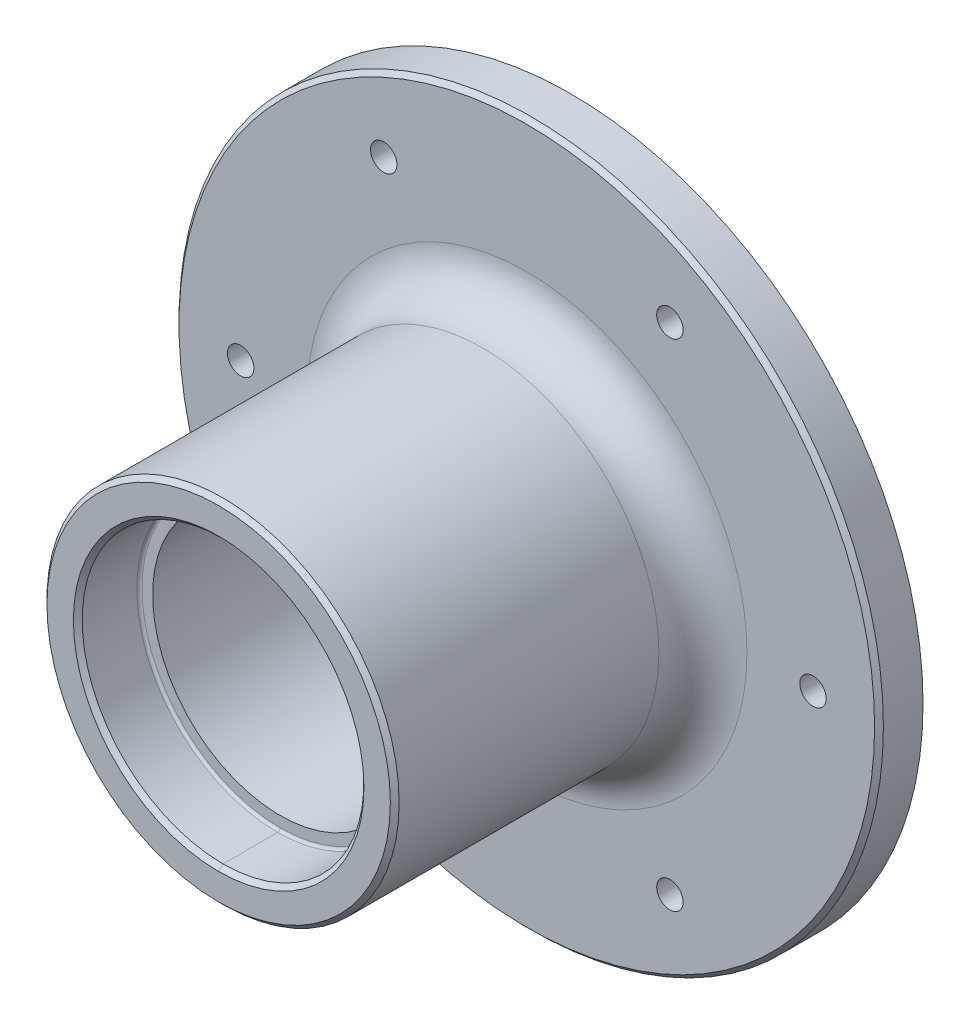
ISO-10303-21;
HEADER;
FILE_DESCRIPTION(('STEP AP214'),'2;1');
FILE_NAME('part.step','',(''),(''),'','','');
FILE_SCHEMA(('AUTOMOTIVE_DESIGN { 1 0 10303 214 1 1 1 1 }'));
ENDSEC;
DATA;
#1=APPLICATION_CONTEXT('core data for automotive mechanical design processes');
#2=APPLICATION_PROTOCOL_DEFINITION('international standard','automotive_design',2000,#1);
#3=PRODUCT_CONTEXT('',#1,'mechanical');
#4=PRODUCT('Part','Part','',(#3));
#5=PRODUCT_RELATED_PRODUCT_CATEGORY('part','',(#4));
#6=PRODUCT_DEFINITION_FORMATION('','',#4);
#7=PRODUCT_DEFINITION_CONTEXT('part definition',#1,'design');
#8=PRODUCT_DEFINITION('design','',#6,#7);
#9=PRODUCT_DEFINITION_SHAPE('','',#8);
#10=(LENGTH_UNIT() NAMED_UNIT(*) SI_UNIT(.MILLI.,.METRE.));
#11=(NAMED_UNIT(*) PLANE_ANGLE_UNIT() SI_UNIT($,.RADIAN.));
#12=(NAMED_UNIT(*) SI_UNIT($,.STERADIAN.) SOLID_ANGLE_UNIT());
#13=UNCERTAINTY_MEASURE_WITH_UNIT(LENGTH_MEASURE(1.E-05),#10,'distance_accuracy_value','');
#14=(GEOMETRIC_REPRESENTATION_CONTEXT(3) GLOBAL_UNCERTAINTY_ASSIGNED_CONTEXT((#13)) GLOBAL_UNIT_ASSIGNED_CONTEXT((#10,
#11,#12)) REPRESENTATION_CONTEXT('',''));
#15=CARTESIAN_POINT('',(0.,0.,0.));
#16=DIRECTION('',(0.,0.,1.));
#17=DIRECTION('',(1.,0.,0.));
#18=AXIS2_PLACEMENT_3D('',#15,#16,#17);
#19=CARTESIAN_POINT('',(0.,0.,56.3012313454445));
#20=DIRECTION('',(0.,0.,1.));
#21=DIRECTION('',(1.,0.,0.));
#22=AXIS2_PLACEMENT_3D('',#19,#20,#21);
#23=CYLINDRICAL_SURFACE('',#22,16.);
#24=DIRECTION('',(0.,0.,1.));
#25=VECTOR('',#24,1.);
#26=CARTESIAN_POINT('',(2.6562498279557E-13,16.,56.3012313454445));
#27=LINE('',#26,#25);
#28=CARTESIAN_POINT('',(2.6562498279557E-13,16.,39.5));
#29=VERTEX_POINT('',#28);
#30=CARTESIAN_POINT('',(2.6562498279557E-13,16.,33.3));
#31=VERTEX_POINT('',#30);
#32=EDGE_CURVE('E197',#29,#31,#27,.F.);
#33=ORIENTED_EDGE('',*,*,#32,.T.);
#34=CARTESIAN_POINT('',(0.,0.,33.3));
#35=DIRECTION('',(0.,0.,1.));
#36=DIRECTION('',(1.,0.,0.));
#37=AXIS2_PLACEMENT_3D('',#34,#35,#36);
#38=CIRCLE('',#37,16.);
#39=CARTESIAN_POINT('',(2.6562498279557E-13,-16.,33.3));
#40=VERTEX_POINT('',#39);
#41=EDGE_CURVE('E45',#31,#40,#38,.F.);
#42=ORIENTED_EDGE('',*,*,#41,.T.);
#43=DIRECTION('',(0.,0.,1.));
#44=VECTOR('',#43,1.);
#45=CARTESIAN_POINT('',(2.6562498279557E-13,-16.,56.3012313454445));
#46=LINE('',#45,#44);
#47=CARTESIAN_POINT('',(2.6562498279557E-13,-16.,39.5));
#48=VERTEX_POINT('',#47);
#49=EDGE_CURVE('E120',#40,#48,#46,.T.);
#50=ORIENTED_EDGE('',*,*,#49,.T.);
#51=CARTESIAN_POINT('',(0.,0.,39.5));
#52=DIRECTION('',(0.,0.,1.));
#53=DIRECTION('',(1.,0.,0.));
#54=AXIS2_PLACEMENT_3D('',#51,#52,#53);
#55=CIRCLE('',#54,16.);
#56=EDGE_CURVE('E141',#48,#29,#55,.T.);
#57=ORIENTED_EDGE('',*,*,#56,.T.);
#58=EDGE_LOOP('',(#33,#42,#50,#57));
#59=FACE_BOUND('',#58,.T.);
#60=ADVANCED_FACE('F36',(#59),#23,.F.);
#61=CARTESIAN_POINT('',(0.,0.,56.3012313454445));
#62=DIRECTION('',(0.,0.,1.));
#63=DIRECTION('',(1.,0.,0.));
#64=AXIS2_PLACEMENT_3D('',#61,#62,#63);
#65=CYLINDRICAL_SURFACE('',#64,16.);
#66=DIRECTION('',(0.,0.,1.));
#67=VECTOR('',#66,1.);
#68=CARTESIAN_POINT('',(0.,-16.,56.3012313454445));
#69=LINE('',#68,#67);
#70=CARTESIAN_POINT('',(0.,-16.,0.500000000000007));
#71=VERTEX_POINT('',#70);
#72=CARTESIAN_POINT('',(0.,-16.,6.7));
#73=VERTEX_POINT('',#72);
#74=EDGE_CURVE('E193',#71,#73,#69,.T.);
#75=ORIENTED_EDGE('',*,*,#74,.T.);
#76=CARTESIAN_POINT('',(0.,0.,6.7));
#77=DIRECTION('',(0.,0.,-1.));
#78=DIRECTION('',(-1.,0.,0.));
#79=AXIS2_PLACEMENT_3D('',#76,#77,#78);
#80=CIRCLE('',#79,16.);
#81=CARTESIAN_POINT('',(0.,16.,6.7));
#82=VERTEX_POINT('',#81);
#83=EDGE_CURVE('E11',#73,#82,#80,.F.);
#84=ORIENTED_EDGE('',*,*,#83,.T.);
#85=DIRECTION('',(0.,0.,1.));
#86=VECTOR('',#85,1.);
#87=CARTESIAN_POINT('',(0.,16.,56.3012313454445));
#88=LINE('',#87,#86);
#89=CARTESIAN_POINT('',(0.,16.,0.500000000000007));
#90=VERTEX_POINT('',#89);
#91=EDGE_CURVE('E194',#82,#90,#88,.F.);
#92=ORIENTED_EDGE('',*,*,#91,.T.);
#93=CARTESIAN_POINT('',(0.,0.,0.500000000000007));
#94=DIRECTION('',(0.,0.,1.));
#95=DIRECTION('',(1.,0.,0.));
#96=AXIS2_PLACEMENT_3D('',#93,#94,#95);
#97=CIRCLE('',#96,16.);
#98=EDGE_CURVE('E125',#90,#71,#97,.F.);
#99=ORIENTED_EDGE('',*,*,#98,.T.);
#100=EDGE_LOOP('',(#75,#84,#92,#99));
#101=FACE_BOUND('',#100,.T.);
#102=ADVANCED_FACE('F195',(#101),#65,.F.);
#103=CARTESIAN_POINT('',(0.,0.,0.));
#104=DIRECTION('',(0.,0.,1.));
#105=DIRECTION('',(1.,0.,0.));
#106=AXIS2_PLACEMENT_3D('',#103,#104,#105);
#107=PLANE('',#106);
#108=CARTESIAN_POINT('',(0.,0.,0.));
#109=DIRECTION('',(0.,0.,1.));
#110=DIRECTION('',(1.,0.,0.));
#111=AXIS2_PLACEMENT_3D('',#108,#109,#110);
#112=CIRCLE('',#111,16.5);
#113=CARTESIAN_POINT('',(0.,-16.5,0.));
#114=VERTEX_POINT('',#113);
#115=CARTESIAN_POINT('',(0.,16.5,0.));
#116=VERTEX_POINT('',#115);
#117=EDGE_CURVE('E117',#114,#116,#112,.T.);
#118=ORIENTED_EDGE('',*,*,#117,.T.);
#119=CARTESIAN_POINT('',(0.,0.,0.));
#120=DIRECTION('',(0.,0.,1.));
#121=DIRECTION('',(1.,0.,0.));
#122=AXIS2_PLACEMENT_3D('',#119,#120,#121);
#123=CIRCLE('',#122,16.5);
#124=EDGE_CURVE('E108',#116,#114,#123,.T.);
#125=ORIENTED_EDGE('',*,*,#124,.T.);
#126=EDGE_LOOP('',(#118,#125));
#127=FACE_BOUND('',#126,.T.);
#128=CARTESIAN_POINT('',(16.2500000000003,28.1458256229941,0.));
#129=DIRECTION('',(0.,0.,-1.));
#130=DIRECTION('',(-1.,0.,0.));
#131=AXIS2_PLACEMENT_3D('',#128,#129,#130);
#132=CIRCLE('',#131,1.49999999999999);
#133=CARTESIAN_POINT('',(14.7500000000003,28.1458256229941,0.));
#134=VERTEX_POINT('',#133);
#135=EDGE_CURVE('E154',#134,#134,#132,.T.);
#136=ORIENTED_EDGE('',*,*,#135,.F.);
#137=EDGE_LOOP('',(#136));
#138=FACE_BOUND('',#137,.T.);
#139=CARTESIAN_POINT('',(-16.2499999999997,28.1458256229944,0.));
#140=DIRECTION('',(0.,0.,-1.));
#141=DIRECTION('',(-1.,0.,0.));
#142=AXIS2_PLACEMENT_3D('',#139,#140,#141);
#143=CIRCLE('',#142,1.49999999999999);
#144=CARTESIAN_POINT('',(-17.7499999999997,28.1458256229944,0.));
#145=VERTEX_POINT('',#144);
#146=EDGE_CURVE('E278',#145,#145,#143,.T.);
#147=ORIENTED_EDGE('',*,*,#146,.F.);
#148=EDGE_LOOP('',(#147));
#149=FACE_BOUND('',#148,.T.);
#150=CARTESIAN_POINT('',(-32.5,0.,0.));
#151=DIRECTION('',(0.,0.,-1.));
#152=DIRECTION('',(-1.,0.,0.));
#153=AXIS2_PLACEMENT_3D('',#150,#151,#152);
#154=CIRCLE('',#153,1.49999999999999);
#155=CARTESIAN_POINT('',(-34.,0.,0.));
#156=VERTEX_POINT('',#155);
#157=EDGE_CURVE('E272',#156,#156,#154,.T.);
#158=ORIENTED_EDGE('',*,*,#157,.F.);
#159=EDGE_LOOP('',(#158));
#160=FACE_BOUND('',#159,.T.);
#161=CARTESIAN_POINT('',(-16.2500000000001,-28.1458256229942,0.));
#162=DIRECTION('',(0.,0.,-1.));
#163=DIRECTION('',(-1.,0.,0.));
#164=AXIS2_PLACEMENT_3D('',#161,#162,#163);
#165=CIRCLE('',#164,1.49999999999999);
#166=CARTESIAN_POINT('',(-17.7500000000001,-28.1458256229942,0.));
#167=VERTEX_POINT('',#166);
#168=EDGE_CURVE('E266',#167,#167,#165,.T.);
#169=ORIENTED_EDGE('',*,*,#168,.F.);
#170=EDGE_LOOP('',(#169));
#171=FACE_BOUND('',#170,.T.);
#172=CARTESIAN_POINT('',(32.5,0.,0.));
#173=DIRECTION('',(0.,0.,-1.));
#174=DIRECTION('',(-1.,0.,0.));
#175=AXIS2_PLACEMENT_3D('',#172,#173,#174);
#176=CIRCLE('',#175,1.49999999999999);
#177=CARTESIAN_POINT('',(31.,0.,0.));
#178=VERTEX_POINT('',#177);
#179=EDGE_CURVE('E254',#178,#178,#176,.T.);
#180=ORIENTED_EDGE('',*,*,#179,.F.);
#181=EDGE_LOOP('',(#180));
#182=FACE_BOUND('',#181,.T.);
#183=CARTESIAN_POINT('',(0.,0.,0.));
#184=DIRECTION('',(0.,0.,1.));
#185=DIRECTION('',(1.,0.,0.));
#186=AXIS2_PLACEMENT_3D('',#183,#184,#185);
#187=CIRCLE('',#186,40.);
#188=CARTESIAN_POINT('',(40.,0.,0.));
#189=VERTEX_POINT('',#188);
#190=EDGE_CURVE('E204',#189,#189,#187,.T.);
#191=ORIENTED_EDGE('',*,*,#190,.F.);
#192=EDGE_LOOP('',(#191));
#193=FACE_BOUND('',#192,.T.);
#194=CARTESIAN_POINT('',(16.2499999999999,-28.1458256229943,0.));
#195=DIRECTION('',(0.,0.,-1.));
#196=DIRECTION('',(-1.,0.,0.));
#197=AXIS2_PLACEMENT_3D('',#194,#195,#196);
#198=CIRCLE('',#197,1.49999999999999);
#199=CARTESIAN_POINT('',(14.7499999999999,-28.1458256229943,0.));
#200=VERTEX_POINT('',#199);
#201=EDGE_CURVE('E260',#200,#200,#198,.T.);
#202=ORIENTED_EDGE('',*,*,#201,.F.);
#203=EDGE_LOOP('',(#202));
#204=FACE_BOUND('',#203,.T.);
#205=ADVANCED_FACE('F122',(#127,#138,#149,#160,#171,#182,#193,#204),#107,.F.);
#206=CARTESIAN_POINT('',(0.,0.,5.));
#207=DIRECTION('',(0.,0.,-1.));
#208=DIRECTION('',(-1.,0.,0.));
#209=AXIS2_PLACEMENT_3D('',#206,#207,#208);
#210=CYLINDRICAL_SURFACE('',#209,40.);
#211=CARTESIAN_POINT('',(0.,0.,4.49999999999999));
#212=DIRECTION('',(0.,0.,1.));
#213=DIRECTION('',(1.,0.,0.));
#214=AXIS2_PLACEMENT_3D('',#211,#212,#213);
#215=CIRCLE('',#214,40.);
#216=CARTESIAN_POINT('',(40.,0.,4.49999999999999));
#217=VERTEX_POINT('',#216);
#218=EDGE_CURVE('E149',#217,#217,#215,.F.);
#219=ORIENTED_EDGE('',*,*,#218,.T.);
#220=EDGE_LOOP('',(#219));
#221=FACE_BOUND('',#220,.T.);
#222=ORIENTED_EDGE('',*,*,#190,.T.);
#223=EDGE_LOOP('',(#222));
#224=FACE_BOUND('',#223,.T.);
#225=ADVANCED_FACE('F290',(#221,#224),#210,.T.);
#226=CARTESIAN_POINT('',(0.,0.,5.));
#227=DIRECTION('',(0.,0.,1.));
#228=DIRECTION('',(1.,0.,0.));
#229=AXIS2_PLACEMENT_3D('',#226,#227,#228);
#230=PLANE('',#229);
#231=CARTESIAN_POINT('',(0.,0.,5.));
#232=DIRECTION('',(0.,0.,1.));
#233=DIRECTION('',(1.,0.,0.));
#234=AXIS2_PLACEMENT_3D('',#231,#232,#233);
#235=CIRCLE('',#234,25.);
#236=CARTESIAN_POINT('',(25.,0.,5.));
#237=VERTEX_POINT('',#236);
#238=EDGE_CURVE('E162',#237,#237,#235,.F.);
#239=ORIENTED_EDGE('',*,*,#238,.T.);
#240=EDGE_LOOP('',(#239));
#241=FACE_BOUND('',#240,.T.);
#242=CARTESIAN_POINT('',(0.,0.,5.));
#243=DIRECTION('',(0.,0.,1.));
#244=DIRECTION('',(1.,0.,0.));
#245=AXIS2_PLACEMENT_3D('',#242,#243,#244);
#246=CIRCLE('',#245,39.5);
#247=CARTESIAN_POINT('',(39.5,0.,5.));
#248=VERTEX_POINT('',#247);
#249=EDGE_CURVE('E146',#248,#248,#246,.T.);
#250=ORIENTED_EDGE('',*,*,#249,.T.);
#251=EDGE_LOOP('',(#250));
#252=FACE_BOUND('',#251,.T.);
#253=CARTESIAN_POINT('',(16.2500000000003,28.1458256229941,5.));
#254=DIRECTION('',(0.,0.,1.));
#255=DIRECTION('',(1.,0.,0.));
#256=AXIS2_PLACEMENT_3D('',#253,#254,#255);
#257=CIRCLE('',#256,1.49999999999999);
#258=CARTESIAN_POINT('',(17.7500000000003,28.1458256229941,5.));
#259=VERTEX_POINT('',#258);
#260=EDGE_CURVE('E281',#259,#259,#257,.T.);
#261=ORIENTED_EDGE('',*,*,#260,.F.);
#262=EDGE_LOOP('',(#261));
#263=FACE_BOUND('',#262,.T.);
#264=CARTESIAN_POINT('',(-16.2499999999997,28.1458256229944,5.));
#265=DIRECTION('',(0.,0.,1.));
#266=DIRECTION('',(1.,0.,0.));
#267=AXIS2_PLACEMENT_3D('',#264,#265,#266);
#268=CIRCLE('',#267,1.49999999999999);
#269=CARTESIAN_POINT('',(-14.7499999999997,28.1458256229944,5.));
#270=VERTEX_POINT('',#269);
#271=EDGE_CURVE('E275',#270,#270,#268,.T.);
#272=ORIENTED_EDGE('',*,*,#271,.F.);
#273=EDGE_LOOP('',(#272));
#274=FACE_BOUND('',#273,.T.);
#275=CARTESIAN_POINT('',(-32.5,0.,5.));
#276=DIRECTION('',(0.,0.,1.));
#277=DIRECTION('',(1.,0.,0.));
#278=AXIS2_PLACEMENT_3D('',#275,#276,#277);
#279=CIRCLE('',#278,1.49999999999999);
#280=CARTESIAN_POINT('',(-31.,0.,5.));
#281=VERTEX_POINT('',#280);
#282=EDGE_CURVE('E269',#281,#281,#279,.T.);
#283=ORIENTED_EDGE('',*,*,#282,.F.);
#284=EDGE_LOOP('',(#283));
#285=FACE_BOUND('',#284,.T.);
#286=CARTESIAN_POINT('',(-16.2500000000001,-28.1458256229942,5.));
#287=DIRECTION('',(0.,0.,1.));
#288=DIRECTION('',(1.,0.,0.));
#289=AXIS2_PLACEMENT_3D('',#286,#287,#288);
#290=CIRCLE('',#289,1.49999999999999);
#291=CARTESIAN_POINT('',(-14.7500000000001,-28.1458256229942,5.));
#292=VERTEX_POINT('',#291);
#293=EDGE_CURVE('E263',#292,#292,#290,.T.);
#294=ORIENTED_EDGE('',*,*,#293,.F.);
#295=EDGE_LOOP('',(#294));
#296=FACE_BOUND('',#295,.T.);
#297=CARTESIAN_POINT('',(16.2499999999999,-28.1458256229943,5.));
#298=DIRECTION('',(0.,0.,1.));
#299=DIRECTION('',(1.,0.,0.));
#300=AXIS2_PLACEMENT_3D('',#297,#298,#299);
#301=CIRCLE('',#300,1.49999999999999);
#302=CARTESIAN_POINT('',(17.7499999999999,-28.1458256229943,5.));
#303=VERTEX_POINT('',#302);
#304=EDGE_CURVE('E257',#303,#303,#301,.T.);
#305=ORIENTED_EDGE('',*,*,#304,.F.);
#306=EDGE_LOOP('',(#305));
#307=FACE_BOUND('',#306,.T.);
#308=CARTESIAN_POINT('',(32.5,0.,5.));
#309=DIRECTION('',(0.,0.,1.));
#310=DIRECTION('',(1.,0.,0.));
#311=AXIS2_PLACEMENT_3D('',#308,#309,#310);
#312=CIRCLE('',#311,1.49999999999999);
#313=CARTESIAN_POINT('',(34.,0.,5.));
#314=VERTEX_POINT('',#313);
#315=EDGE_CURVE('E207',#314,#314,#312,.T.);
#316=ORIENTED_EDGE('',*,*,#315,.F.);
#317=EDGE_LOOP('',(#316));
#318=FACE_BOUND('',#317,.T.);
#319=ADVANCED_FACE('F336',(#241,#252,#263,#274,#285,#296,#307,#318),#230,.T.);
#320=CARTESIAN_POINT('',(0.,0.,40.));
#321=DIRECTION('',(0.,0.,-1.));
#322=DIRECTION('',(-1.,0.,0.));
#323=AXIS2_PLACEMENT_3D('',#320,#321,#322);
#324=CYLINDRICAL_SURFACE('',#323,20.);
#325=CARTESIAN_POINT('',(0.,0.,10.));
#326=DIRECTION('',(0.,0.,1.));
#327=DIRECTION('',(1.,0.,0.));
#328=AXIS2_PLACEMENT_3D('',#325,#326,#327);
#329=CIRCLE('',#328,20.);
#330=CARTESIAN_POINT('',(20.,0.,10.));
#331=VERTEX_POINT('',#330);
#332=EDGE_CURVE('E151',#331,#331,#329,.T.);
#333=ORIENTED_EDGE('',*,*,#332,.T.);
#334=EDGE_LOOP('',(#333));
#335=FACE_BOUND('',#334,.T.);
#336=CARTESIAN_POINT('',(0.,0.,39.5));
#337=DIRECTION('',(0.,0.,1.));
#338=DIRECTION('',(1.,0.,0.));
#339=AXIS2_PLACEMENT_3D('',#336,#337,#338);
#340=CIRCLE('',#339,20.);
#341=CARTESIAN_POINT('',(20.,0.,39.5));
#342=VERTEX_POINT('',#341);
#343=EDGE_CURVE('E143',#342,#342,#340,.F.);
#344=ORIENTED_EDGE('',*,*,#343,.T.);
#345=EDGE_LOOP('',(#344));
#346=FACE_BOUND('',#345,.T.);
#347=ADVANCED_FACE('F331',(#335,#346),#324,.T.);
#348=CARTESIAN_POINT('',(0.,0.,40.));
#349=DIRECTION('',(0.,0.,1.));
#350=DIRECTION('',(1.,0.,0.));
#351=AXIS2_PLACEMENT_3D('',#348,#349,#350);
#352=PLANE('',#351);
#353=CARTESIAN_POINT('',(0.,0.,40.));
#354=DIRECTION('',(0.,0.,1.));
#355=DIRECTION('',(1.,0.,0.));
#356=AXIS2_PLACEMENT_3D('',#353,#354,#355);
#357=CIRCLE('',#356,16.5);
#358=CARTESIAN_POINT('',(2.73925763507931E-13,16.5,40.));
#359=VERTEX_POINT('',#358);
#360=CARTESIAN_POINT('',(2.73925763507931E-13,-16.5,40.));
#361=VERTEX_POINT('',#360);
#362=EDGE_CURVE('E136',#359,#361,#357,.F.);
#363=ORIENTED_EDGE('',*,*,#362,.T.);
#364=CARTESIAN_POINT('',(0.,0.,40.));
#365=DIRECTION('',(0.,0.,1.));
#366=DIRECTION('',(1.,0.,0.));
#367=AXIS2_PLACEMENT_3D('',#364,#365,#366);
#368=CIRCLE('',#367,16.5);
#369=EDGE_CURVE('E138',#361,#359,#368,.F.);
#370=ORIENTED_EDGE('',*,*,#369,.T.);
#371=EDGE_LOOP('',(#363,#370));
#372=FACE_BOUND('',#371,.T.);
#373=CARTESIAN_POINT('',(0.,0.,40.));
#374=DIRECTION('',(0.,0.,1.));
#375=DIRECTION('',(1.,0.,0.));
#376=AXIS2_PLACEMENT_3D('',#373,#374,#375);
#377=CIRCLE('',#376,19.5);
#378=CARTESIAN_POINT('',(19.5,0.,40.));
#379=VERTEX_POINT('',#378);
#380=EDGE_CURVE('E133',#379,#379,#377,.T.);
#381=ORIENTED_EDGE('',*,*,#380,.T.);
#382=EDGE_LOOP('',(#381));
#383=FACE_BOUND('',#382,.T.);
#384=ADVANCED_FACE('F327',(#372,#383),#352,.T.);
#385=ORIENTED_EDGE('',*,*,#49,.F.);
#386=CARTESIAN_POINT('',(0.,0.,33.3));
#387=DIRECTION('',(0.,0.,1.));
#388=DIRECTION('',(1.,0.,0.));
#389=AXIS2_PLACEMENT_3D('',#386,#387,#388);
#390=CIRCLE('',#389,16.);
#391=EDGE_CURVE('E170',#40,#31,#390,.F.);
#392=ORIENTED_EDGE('',*,*,#391,.T.);
#393=ORIENTED_EDGE('',*,*,#32,.F.);
#394=CARTESIAN_POINT('',(0.,0.,39.5));
#395=DIRECTION('',(0.,0.,1.));
#396=DIRECTION('',(1.,0.,0.));
#397=AXIS2_PLACEMENT_3D('',#394,#395,#396);
#398=CIRCLE('',#397,16.);
#399=EDGE_CURVE('E130',#29,#48,#398,.T.);
#400=ORIENTED_EDGE('',*,*,#399,.T.);
#401=EDGE_LOOP('',(#385,#392,#393,#400));
#402=FACE_BOUND('',#401,.T.);
#403=ADVANCED_FACE('F229',(#402),#23,.F.);
#404=CARTESIAN_POINT('',(0.,16.,33.));
#405=DIRECTION('',(0.,0.,1.));
#406=DIRECTION('',(1.,0.,0.));
#407=AXIS2_PLACEMENT_3D('',#404,#405,#406);
#408=PLANE('',#407);
#409=CARTESIAN_POINT('',(0.,0.,33.));
#410=DIRECTION('',(0.,0.,1.));
#411=DIRECTION('',(1.,0.,0.));
#412=AXIS2_PLACEMENT_3D('',#409,#410,#411);
#413=CIRCLE('',#412,15.7);
#414=CARTESIAN_POINT('',(2.60644514368153E-13,-15.7,33.));
#415=VERTEX_POINT('',#414);
#416=CARTESIAN_POINT('',(2.60644514368153E-13,15.7,33.));
#417=VERTEX_POINT('',#416);
#418=EDGE_CURVE('E165',#415,#417,#413,.T.);
#419=ORIENTED_EDGE('',*,*,#418,.T.);
#420=CARTESIAN_POINT('',(0.,0.,33.));
#421=DIRECTION('',(0.,0.,1.));
#422=DIRECTION('',(1.,0.,0.));
#423=AXIS2_PLACEMENT_3D('',#420,#421,#422);
#424=CIRCLE('',#423,15.7);
#425=EDGE_CURVE('E167',#417,#415,#424,.T.);
#426=ORIENTED_EDGE('',*,*,#425,.T.);
#427=EDGE_LOOP('',(#419,#426));
#428=FACE_BOUND('',#427,.T.);
#429=CARTESIAN_POINT('',(0.,0.,33.));
#430=DIRECTION('',(0.,0.,1.));
#431=DIRECTION('',(1.,0.,0.));
#432=AXIS2_PLACEMENT_3D('',#429,#430,#431);
#433=CIRCLE('',#432,14.5);
#434=CARTESIAN_POINT('',(14.5,0.,33.));
#435=VERTEX_POINT('',#434);
#436=EDGE_CURVE('E246',#435,#435,#433,.T.);
#437=ORIENTED_EDGE('',*,*,#436,.F.);
#438=EDGE_LOOP('',(#437));
#439=FACE_BOUND('',#438,.T.);
#440=ADVANCED_FACE('F239',(#428,#439),#408,.T.);
#441=CARTESIAN_POINT('',(0.,0.,56.3012313454445));
#442=DIRECTION('',(0.,0.,1.));
#443=DIRECTION('',(1.,0.,0.));
#444=AXIS2_PLACEMENT_3D('',#441,#442,#443);
#445=CYLINDRICAL_SURFACE('',#444,14.5);
#446=ORIENTED_EDGE('',*,*,#436,.T.);
#447=EDGE_LOOP('',(#446));
#448=FACE_BOUND('',#447,.T.);
#449=CARTESIAN_POINT('',(0.,0.,7.));
#450=DIRECTION('',(0.,0.,1.));
#451=DIRECTION('',(1.,0.,0.));
#452=AXIS2_PLACEMENT_3D('',#449,#450,#451);
#453=CIRCLE('',#452,14.5);
#454=CARTESIAN_POINT('',(14.5,0.,7.));
#455=VERTEX_POINT('',#454);
#456=EDGE_CURVE('E248',#455,#455,#453,.T.);
#457=ORIENTED_EDGE('',*,*,#456,.F.);
#458=EDGE_LOOP('',(#457));
#459=FACE_BOUND('',#458,.T.);
#460=ADVANCED_FACE('F242',(#448,#459),#445,.F.);
#461=CARTESIAN_POINT('',(0.,14.5,7.));
#462=DIRECTION('',(0.,0.,-1.));
#463=DIRECTION('',(-1.,0.,0.));
#464=AXIS2_PLACEMENT_3D('',#461,#462,#463);
#465=PLANE('',#464);
#466=CARTESIAN_POINT('',(0.,0.,7.));
#467=DIRECTION('',(0.,0.,-1.));
#468=DIRECTION('',(-1.,0.,0.));
#469=AXIS2_PLACEMENT_3D('',#466,#467,#468);
#470=CIRCLE('',#469,15.7);
#471=CARTESIAN_POINT('',(0.,15.7,7.));
#472=VERTEX_POINT('',#471);
#473=CARTESIAN_POINT('',(0.,-15.7,7.));
#474=VERTEX_POINT('',#473);
#475=EDGE_CURVE('E52',#472,#474,#470,.T.);
#476=ORIENTED_EDGE('',*,*,#475,.T.);
#477=CARTESIAN_POINT('',(0.,0.,7.));
#478=DIRECTION('',(0.,0.,-1.));
#479=DIRECTION('',(-1.,0.,0.));
#480=AXIS2_PLACEMENT_3D('',#477,#478,#479);
#481=CIRCLE('',#480,15.7);
#482=EDGE_CURVE('E177',#474,#472,#481,.T.);
#483=ORIENTED_EDGE('',*,*,#482,.T.);
#484=EDGE_LOOP('',(#476,#483));
#485=FACE_BOUND('',#484,.T.);
#486=ORIENTED_EDGE('',*,*,#456,.T.);
#487=EDGE_LOOP('',(#486));
#488=FACE_BOUND('',#487,.T.);
#489=ADVANCED_FACE('F465',(#485,#488),#465,.T.);
#490=ORIENTED_EDGE('',*,*,#91,.F.);
#491=CARTESIAN_POINT('',(0.,0.,6.7));
#492=DIRECTION('',(0.,0.,-1.));
#493=DIRECTION('',(-1.,0.,0.));
#494=AXIS2_PLACEMENT_3D('',#491,#492,#493);
#495=CIRCLE('',#494,16.);
#496=EDGE_CURVE('E173',#82,#73,#495,.F.);
#497=ORIENTED_EDGE('',*,*,#496,.T.);
#498=ORIENTED_EDGE('',*,*,#74,.F.);
#499=CARTESIAN_POINT('',(0.,0.,0.500000000000007));
#500=DIRECTION('',(0.,0.,1.));
#501=DIRECTION('',(1.,0.,0.));
#502=AXIS2_PLACEMENT_3D('',#499,#500,#501);
#503=CIRCLE('',#502,16.);
#504=EDGE_CURVE('E110',#71,#90,#503,.F.);
#505=ORIENTED_EDGE('',*,*,#504,.T.);
#506=EDGE_LOOP('',(#490,#497,#498,#505));
#507=FACE_BOUND('',#506,.T.);
#508=ADVANCED_FACE('F192',(#507),#65,.F.);
#509=CARTESIAN_POINT('',(32.5,0.,0.));
#510=DIRECTION('',(0.,0.,-1.));
#511=DIRECTION('',(-1.,0.,0.));
#512=AXIS2_PLACEMENT_3D('',#509,#510,#511);
#513=CYLINDRICAL_SURFACE('',#512,1.49999999999999);
#514=ORIENTED_EDGE('',*,*,#315,.T.);
#515=EDGE_LOOP('',(#514));
#516=FACE_BOUND('',#515,.T.);
#517=ORIENTED_EDGE('',*,*,#179,.T.);
#518=EDGE_LOOP('',(#517));
#519=FACE_BOUND('',#518,.T.);
#520=ADVANCED_FACE('F307',(#516,#519),#513,.F.);
#521=CARTESIAN_POINT('',(16.2499999999999,-28.1458256229943,0.));
#522=DIRECTION('',(0.,0.,-1.));
#523=DIRECTION('',(-1.,0.,0.));
#524=AXIS2_PLACEMENT_3D('',#521,#522,#523);
#525=CYLINDRICAL_SURFACE('',#524,1.49999999999999);
#526=ORIENTED_EDGE('',*,*,#304,.T.);
#527=EDGE_LOOP('',(#526));
#528=FACE_BOUND('',#527,.T.);
#529=ORIENTED_EDGE('',*,*,#201,.T.);
#530=EDGE_LOOP('',(#529));
#531=FACE_BOUND('',#530,.T.);
#532=ADVANCED_FACE('F304',(#528,#531),#525,.F.);
#533=CARTESIAN_POINT('',(-16.2500000000001,-28.1458256229942,0.));
#534=DIRECTION('',(0.,0.,-1.));
#535=DIRECTION('',(-1.,0.,0.));
#536=AXIS2_PLACEMENT_3D('',#533,#534,#535);
#537=CYLINDRICAL_SURFACE('',#536,1.49999999999999);
#538=ORIENTED_EDGE('',*,*,#293,.T.);
#539=EDGE_LOOP('',(#538));
#540=FACE_BOUND('',#539,.T.);
#541=ORIENTED_EDGE('',*,*,#168,.T.);
#542=EDGE_LOOP('',(#541));
#543=FACE_BOUND('',#542,.T.);
#544=ADVANCED_FACE('F306',(#540,#543),#537,.F.);
#545=CARTESIAN_POINT('',(-32.5,0.,0.));
#546=DIRECTION('',(0.,0.,-1.));
#547=DIRECTION('',(-1.,0.,0.));
#548=AXIS2_PLACEMENT_3D('',#545,#546,#547);
#549=CYLINDRICAL_SURFACE('',#548,1.49999999999999);
#550=ORIENTED_EDGE('',*,*,#282,.T.);
#551=EDGE_LOOP('',(#550));
#552=FACE_BOUND('',#551,.T.);
#553=ORIENTED_EDGE('',*,*,#157,.T.);
#554=EDGE_LOOP('',(#553));
#555=FACE_BOUND('',#554,.T.);
#556=ADVANCED_FACE('F314',(#552,#555),#549,.F.);
#557=CARTESIAN_POINT('',(-16.2499999999997,28.1458256229944,0.));
#558=DIRECTION('',(0.,0.,-1.));
#559=DIRECTION('',(-1.,0.,0.));
#560=AXIS2_PLACEMENT_3D('',#557,#558,#559);
#561=CYLINDRICAL_SURFACE('',#560,1.49999999999999);
#562=ORIENTED_EDGE('',*,*,#271,.T.);
#563=EDGE_LOOP('',(#562));
#564=FACE_BOUND('',#563,.T.);
#565=ORIENTED_EDGE('',*,*,#146,.T.);
#566=EDGE_LOOP('',(#565));
#567=FACE_BOUND('',#566,.T.);
#568=ADVANCED_FACE('F421',(#564,#567),#561,.F.);
#569=CARTESIAN_POINT('',(16.2500000000003,28.1458256229941,0.));
#570=DIRECTION('',(0.,0.,-1.));
#571=DIRECTION('',(-1.,0.,0.));
#572=AXIS2_PLACEMENT_3D('',#569,#570,#571);
#573=CYLINDRICAL_SURFACE('',#572,1.49999999999999);
#574=ORIENTED_EDGE('',*,*,#260,.T.);
#575=EDGE_LOOP('',(#574));
#576=FACE_BOUND('',#575,.T.);
#577=ORIENTED_EDGE('',*,*,#135,.T.);
#578=EDGE_LOOP('',(#577));
#579=FACE_BOUND('',#578,.T.);
#580=ADVANCED_FACE('F287',(#576,#579),#573,.F.);
#581=CARTESIAN_POINT('',(0.,0.,0.));
#582=DIRECTION('',(0.,0.,-1.));
#583=DIRECTION('',(-1.,0.,0.));
#584=AXIS2_PLACEMENT_3D('',#581,#582,#583);
#585=CONICAL_SURFACE('',#584,16.5,0.785398163397462);
#586=DIRECTION('',(0.,-0.707106781186557,-0.707106781186538));
#587=VECTOR('',#586,1.);
#588=CARTESIAN_POINT('',(0.,-16.,0.500000000000007));
#589=LINE('',#588,#587);
#590=EDGE_CURVE('E103',#71,#114,#589,.T.);
#591=ORIENTED_EDGE('',*,*,#590,.F.);
#592=ORIENTED_EDGE('',*,*,#98,.F.);
#593=DIRECTION('',(0.,-0.707106781186557,0.707106781186538));
#594=VECTOR('',#593,1.);
#595=CARTESIAN_POINT('',(0.,16.5,0.));
#596=LINE('',#595,#594);
#597=EDGE_CURVE('E113',#116,#90,#596,.T.);
#598=ORIENTED_EDGE('',*,*,#597,.F.);
#599=ORIENTED_EDGE('',*,*,#117,.F.);
#600=EDGE_LOOP('',(#591,#592,#598,#599));
#601=FACE_BOUND('',#600,.T.);
#602=ADVANCED_FACE('F118',(#601),#585,.F.);
#603=CARTESIAN_POINT('',(0.,0.,0.));
#604=DIRECTION('',(0.,0.,-1.));
#605=DIRECTION('',(-1.,0.,0.));
#606=AXIS2_PLACEMENT_3D('',#603,#604,#605);
#607=CONICAL_SURFACE('',#606,16.5,0.785398163397462);
#608=ORIENTED_EDGE('',*,*,#597,.T.);
#609=ORIENTED_EDGE('',*,*,#504,.F.);
#610=ORIENTED_EDGE('',*,*,#590,.T.);
#611=ORIENTED_EDGE('',*,*,#124,.F.);
#612=EDGE_LOOP('',(#608,#609,#610,#611));
#613=FACE_BOUND('',#612,.T.);
#614=ADVANCED_FACE('F106',(#613),#607,.F.);
#615=CARTESIAN_POINT('',(0.,0.,39.5));
#616=DIRECTION('',(0.,0.,1.));
#617=DIRECTION('',(1.,0.,0.));
#618=AXIS2_PLACEMENT_3D('',#615,#616,#617);
#619=CONICAL_SURFACE('',#618,16.,0.785398163397448);
#620=DIRECTION('',(0.,0.707106781186547,-0.707106781186547));
#621=VECTOR('',#620,1.);
#622=CARTESIAN_POINT('',(2.73925763507931E-13,-16.5,40.));
#623=LINE('',#622,#621);
#624=EDGE_CURVE('E155',#361,#48,#623,.T.);
#625=ORIENTED_EDGE('',*,*,#624,.F.);
#626=ORIENTED_EDGE('',*,*,#362,.F.);
#627=DIRECTION('',(0.,0.707106781186547,0.707106781186547));
#628=VECTOR('',#627,1.);
#629=CARTESIAN_POINT('',(2.6562498279557E-13,16.,39.5));
#630=LINE('',#629,#628);
#631=EDGE_CURVE('E114',#29,#359,#630,.T.);
#632=ORIENTED_EDGE('',*,*,#631,.F.);
#633=ORIENTED_EDGE('',*,*,#56,.F.);
#634=EDGE_LOOP('',(#625,#626,#632,#633));
#635=FACE_BOUND('',#634,.T.);
#636=ADVANCED_FACE('F228',(#635),#619,.F.);
#637=CARTESIAN_POINT('',(0.,0.,39.5));
#638=DIRECTION('',(0.,0.,1.));
#639=DIRECTION('',(1.,0.,0.));
#640=AXIS2_PLACEMENT_3D('',#637,#638,#639);
#641=CONICAL_SURFACE('',#640,16.,0.785398163397448);
#642=ORIENTED_EDGE('',*,*,#631,.T.);
#643=ORIENTED_EDGE('',*,*,#369,.F.);
#644=ORIENTED_EDGE('',*,*,#624,.T.);
#645=ORIENTED_EDGE('',*,*,#399,.F.);
#646=EDGE_LOOP('',(#642,#643,#644,#645));
#647=FACE_BOUND('',#646,.T.);
#648=ADVANCED_FACE('F224',(#647),#641,.F.);
#649=CARTESIAN_POINT('',(0.,0.,40.));
#650=DIRECTION('',(0.,0.,-1.));
#651=DIRECTION('',(-1.,0.,0.));
#652=AXIS2_PLACEMENT_3D('',#649,#650,#651);
#653=CONICAL_SURFACE('',#652,19.5,0.785398163397452);
#654=ORIENTED_EDGE('',*,*,#343,.F.);
#655=EDGE_LOOP('',(#654));
#656=FACE_BOUND('',#655,.T.);
#657=ORIENTED_EDGE('',*,*,#380,.F.);
#658=EDGE_LOOP('',(#657));
#659=FACE_BOUND('',#658,.T.);
#660=ADVANCED_FACE('F353',(#656,#659),#653,.T.);
#661=CARTESIAN_POINT('',(0.,0.,5.));
#662=DIRECTION('',(0.,0.,-1.));
#663=DIRECTION('',(-1.,0.,0.));
#664=AXIS2_PLACEMENT_3D('',#661,#662,#663);
#665=CONICAL_SURFACE('',#664,39.5,0.785398163397448);
#666=ORIENTED_EDGE('',*,*,#218,.F.);
#667=EDGE_LOOP('',(#666));
#668=FACE_BOUND('',#667,.T.);
#669=ORIENTED_EDGE('',*,*,#249,.F.);
#670=EDGE_LOOP('',(#669));
#671=FACE_BOUND('',#670,.T.);
#672=ADVANCED_FACE('F358',(#668,#671),#665,.T.);
#673=CARTESIAN_POINT('',(0.,0.,10.));
#674=DIRECTION('',(0.,0.,1.));
#675=DIRECTION('',(1.,0.,0.));
#676=AXIS2_PLACEMENT_3D('',#673,#674,#675);
#677=TOROIDAL_SURFACE('',#676,25.,5.);
#678=ORIENTED_EDGE('',*,*,#238,.F.);
#679=EDGE_LOOP('',(#678));
#680=FACE_BOUND('',#679,.T.);
#681=ORIENTED_EDGE('',*,*,#332,.F.);
#682=EDGE_LOOP('',(#681));
#683=FACE_BOUND('',#682,.T.);
#684=ADVANCED_FACE('F362',(#680,#683),#677,.F.);
#685=CARTESIAN_POINT('',(0.,0.,33.3));
#686=DIRECTION('',(0.,0.,1.));
#687=DIRECTION('',(1.,0.,0.));
#688=AXIS2_PLACEMENT_3D('',#685,#686,#687);
#689=TOROIDAL_SURFACE('',#688,15.7,0.3);
#690=CARTESIAN_POINT('',(2.60644514368153E-13,-15.7,33.3));
#691=DIRECTION('',(1.,0.,0.));
#692=DIRECTION('',(0.,1.,0.));
#693=AXIS2_PLACEMENT_3D('',#690,#691,#692);
#694=CIRCLE('',#693,0.3);
#695=EDGE_CURVE('E180',#40,#415,#694,.T.);
#696=ORIENTED_EDGE('',*,*,#695,.F.);
#697=ORIENTED_EDGE('',*,*,#41,.F.);
#698=CARTESIAN_POINT('',(2.60644514368153E-13,15.7,33.3));
#699=DIRECTION('',(1.,0.,0.));
#700=DIRECTION('',(0.,1.,0.));
#701=AXIS2_PLACEMENT_3D('',#698,#699,#700);
#702=CIRCLE('',#701,0.3);
#703=EDGE_CURVE('E158',#417,#31,#702,.T.);
#704=ORIENTED_EDGE('',*,*,#703,.F.);
#705=ORIENTED_EDGE('',*,*,#418,.F.);
#706=EDGE_LOOP('',(#696,#697,#704,#705));
#707=FACE_BOUND('',#706,.T.);
#708=ADVANCED_FACE('F237',(#707),#689,.F.);
#709=CARTESIAN_POINT('',(0.,0.,33.3));
#710=DIRECTION('',(0.,0.,1.));
#711=DIRECTION('',(1.,0.,0.));
#712=AXIS2_PLACEMENT_3D('',#709,#710,#711);
#713=TOROIDAL_SURFACE('',#712,15.7,0.3);
#714=ORIENTED_EDGE('',*,*,#703,.T.);
#715=ORIENTED_EDGE('',*,*,#391,.F.);
#716=ORIENTED_EDGE('',*,*,#695,.T.);
#717=ORIENTED_EDGE('',*,*,#425,.F.);
#718=EDGE_LOOP('',(#714,#715,#716,#717));
#719=FACE_BOUND('',#718,.T.);
#720=ADVANCED_FACE('F232',(#719),#713,.F.);
#721=CARTESIAN_POINT('',(0.,0.,6.7));
#722=DIRECTION('',(0.,0.,-1.));
#723=DIRECTION('',(-1.,0.,0.));
#724=AXIS2_PLACEMENT_3D('',#721,#722,#723);
#725=TOROIDAL_SURFACE('',#724,15.7,0.3);
#726=CARTESIAN_POINT('',(0.,-15.7,6.7));
#727=DIRECTION('',(1.,0.,0.));
#728=DIRECTION('',(0.,0.,-1.));
#729=AXIS2_PLACEMENT_3D('',#726,#727,#728);
#730=CIRCLE('',#729,0.3);
#731=EDGE_CURVE('E182',#474,#73,#730,.T.);
#732=ORIENTED_EDGE('',*,*,#731,.F.);
#733=ORIENTED_EDGE('',*,*,#475,.F.);
#734=CARTESIAN_POINT('',(0.,15.7,6.7));
#735=DIRECTION('',(1.,0.,0.));
#736=DIRECTION('',(0.,0.,-1.));
#737=AXIS2_PLACEMENT_3D('',#734,#735,#736);
#738=CIRCLE('',#737,0.3);
#739=EDGE_CURVE('E40',#82,#472,#738,.T.);
#740=ORIENTED_EDGE('',*,*,#739,.F.);
#741=ORIENTED_EDGE('',*,*,#83,.F.);
#742=EDGE_LOOP('',(#732,#733,#740,#741));
#743=FACE_BOUND('',#742,.T.);
#744=ADVANCED_FACE('F38',(#743),#725,.F.);
#745=CARTESIAN_POINT('',(0.,0.,6.7));
#746=DIRECTION('',(0.,0.,-1.));
#747=DIRECTION('',(-1.,0.,0.));
#748=AXIS2_PLACEMENT_3D('',#745,#746,#747);
#749=TOROIDAL_SURFACE('',#748,15.7,0.3);
#750=ORIENTED_EDGE('',*,*,#739,.T.);
#751=ORIENTED_EDGE('',*,*,#482,.F.);
#752=ORIENTED_EDGE('',*,*,#731,.T.);
#753=ORIENTED_EDGE('',*,*,#496,.F.);
#754=EDGE_LOOP('',(#750,#751,#752,#753));
#755=FACE_BOUND('',#754,.T.);
#756=ADVANCED_FACE('F185',(#755),#749,.F.);
#757=CLOSED_SHELL('',(#60,#102,#205,#225,#319,#347,#384,#403,#440,#460,#489,#508,#520,#532,#544,
#556,#568,#580,#602,#614,#636,#648,#660,#672,#684,#708,#720,#744,#756));
#758=MANIFOLD_SOLID_BREP('B2',#757);
#759=ADVANCED_BREP_SHAPE_REPRESENTATION('',(#18,#758),#14);
#760=SHAPE_DEFINITION_REPRESENTATION(#9,#759);
ENDSEC;
END-ISO-10303-21;
